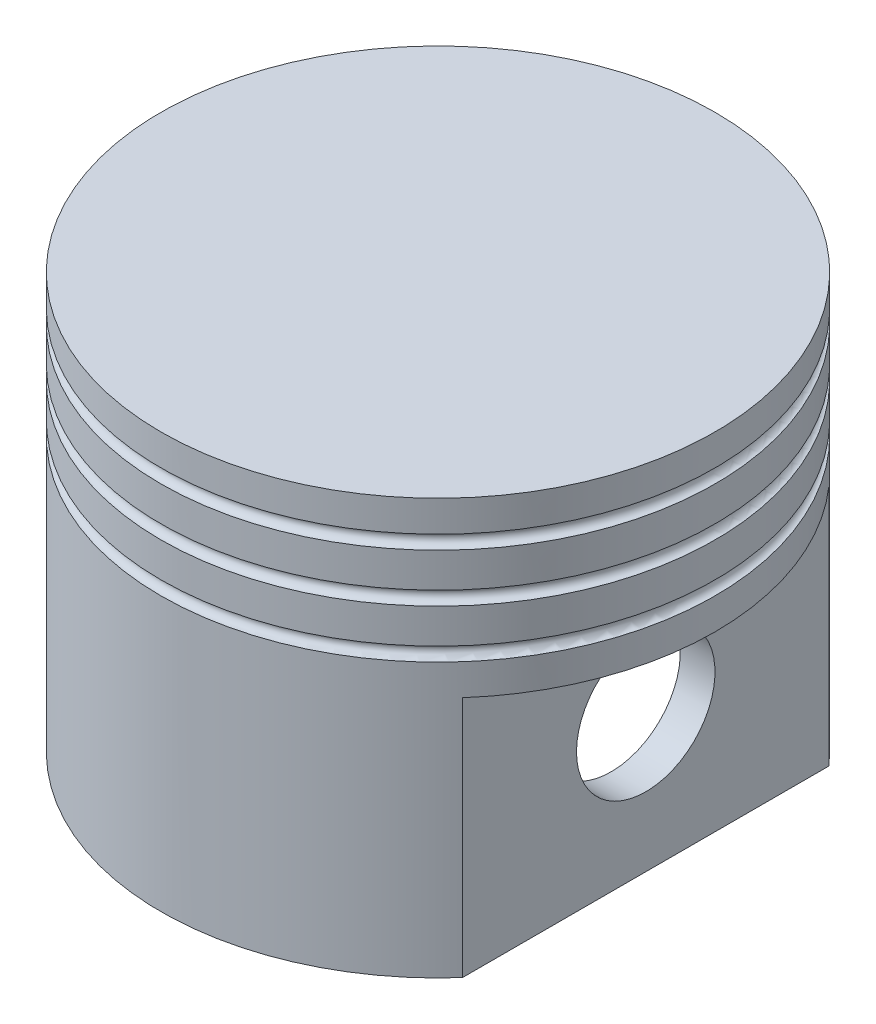
ISO-10303-21;
HEADER;
FILE_DESCRIPTION(('STEP AP214'),'2;1');
FILE_NAME('part.step','',(''),(''),'','','');
FILE_SCHEMA(('AUTOMOTIVE_DESIGN { 1 0 10303 214 1 1 1 1 }'));
ENDSEC;
DATA;
#1=APPLICATION_CONTEXT('core data for automotive mechanical design processes');
#2=APPLICATION_PROTOCOL_DEFINITION('international standard','automotive_design',2000,#1);
#3=PRODUCT_CONTEXT('',#1,'mechanical');
#4=PRODUCT('Part','Part','',(#3));
#5=PRODUCT_RELATED_PRODUCT_CATEGORY('part','',(#4));
#6=PRODUCT_DEFINITION_FORMATION('','',#4);
#7=PRODUCT_DEFINITION_CONTEXT('part definition',#1,'design');
#8=PRODUCT_DEFINITION('design','',#6,#7);
#9=PRODUCT_DEFINITION_SHAPE('','',#8);
#10=(LENGTH_UNIT() NAMED_UNIT(*) SI_UNIT(.MILLI.,.METRE.));
#11=(NAMED_UNIT(*) PLANE_ANGLE_UNIT() SI_UNIT($,.RADIAN.));
#12=(NAMED_UNIT(*) SI_UNIT($,.STERADIAN.) SOLID_ANGLE_UNIT());
#13=UNCERTAINTY_MEASURE_WITH_UNIT(LENGTH_MEASURE(1.E-05),#10,'distance_accuracy_value','');
#14=(GEOMETRIC_REPRESENTATION_CONTEXT(3) GLOBAL_UNCERTAINTY_ASSIGNED_CONTEXT((#13)) GLOBAL_UNIT_ASSIGNED_CONTEXT((#10,
#11,#12)) REPRESENTATION_CONTEXT('',''));
#15=CARTESIAN_POINT('',(0.,0.,0.));
#16=DIRECTION('',(0.,0.,1.));
#17=DIRECTION('',(1.,0.,0.));
#18=AXIS2_PLACEMENT_3D('',#15,#16,#17);
#19=CARTESIAN_POINT('',(0.,60.,0.));
#20=DIRECTION('',(0.,-1.,0.));
#21=DIRECTION('',(0.,0.,-1.));
#22=AXIS2_PLACEMENT_3D('',#19,#20,#21);
#23=CYLINDRICAL_SURFACE('',#22,40.);
#24=CARTESIAN_POINT('',(0.,41.5,0.));
#25=DIRECTION('',(0.,-1.,0.));
#26=DIRECTION('',(0.,0.,-1.));
#27=AXIS2_PLACEMENT_3D('',#24,#25,#26);
#28=CIRCLE('',#27,40.);
#29=CARTESIAN_POINT('',(0.,41.5,-40.));
#30=VERTEX_POINT('',#29);
#31=EDGE_CURVE('E266',#30,#30,#28,.F.);
#32=ORIENTED_EDGE('',*,*,#31,.T.);
#33=EDGE_LOOP('',(#32));
#34=FACE_BOUND('',#33,.T.);
#35=CARTESIAN_POINT('',(0.,46.5,0.));
#36=DIRECTION('',(0.,1.,0.));
#37=DIRECTION('',(0.,0.,1.));
#38=AXIS2_PLACEMENT_3D('',#35,#36,#37);
#39=CIRCLE('',#38,40.);
#40=CARTESIAN_POINT('',(0.,46.5,40.));
#41=VERTEX_POINT('',#40);
#42=EDGE_CURVE('E263',#41,#41,#39,.F.);
#43=ORIENTED_EDGE('',*,*,#42,.T.);
#44=EDGE_LOOP('',(#43));
#45=FACE_BOUND('',#44,.T.);
#46=ADVANCED_FACE('F40',(#34,#45),#23,.T.);
#47=CARTESIAN_POINT('',(0.,48.5,0.));
#48=DIRECTION('',(0.,-1.,0.));
#49=DIRECTION('',(0.,0.,-1.));
#50=AXIS2_PLACEMENT_3D('',#47,#48,#49);
#51=CIRCLE('',#50,40.);
#52=CARTESIAN_POINT('',(0.,48.5,-40.));
#53=VERTEX_POINT('',#52);
#54=EDGE_CURVE('E259',#53,#53,#51,.F.);
#55=ORIENTED_EDGE('',*,*,#54,.T.);
#56=EDGE_LOOP('',(#55));
#57=FACE_BOUND('',#56,.T.);
#58=CARTESIAN_POINT('',(0.,53.5,0.));
#59=DIRECTION('',(0.,1.,0.));
#60=DIRECTION('',(0.,0.,1.));
#61=AXIS2_PLACEMENT_3D('',#58,#59,#60);
#62=CIRCLE('',#61,40.);
#63=CARTESIAN_POINT('',(0.,53.5,40.));
#64=VERTEX_POINT('',#63);
#65=EDGE_CURVE('E254',#64,#64,#62,.F.);
#66=ORIENTED_EDGE('',*,*,#65,.T.);
#67=EDGE_LOOP('',(#66));
#68=FACE_BOUND('',#67,.T.);
#69=ADVANCED_FACE('F215',(#57,#68),#23,.T.);
#70=CARTESIAN_POINT('',(0.,55.5,0.));
#71=DIRECTION('',(0.,-1.,0.));
#72=DIRECTION('',(0.,0.,-1.));
#73=AXIS2_PLACEMENT_3D('',#70,#71,#72);
#74=CIRCLE('',#73,40.);
#75=CARTESIAN_POINT('',(0.,55.5,-40.));
#76=VERTEX_POINT('',#75);
#77=EDGE_CURVE('E250',#76,#76,#74,.F.);
#78=ORIENTED_EDGE('',*,*,#77,.T.);
#79=EDGE_LOOP('',(#78));
#80=FACE_BOUND('',#79,.T.);
#81=CARTESIAN_POINT('',(0.,60.,0.));
#82=DIRECTION('',(0.,1.,0.));
#83=DIRECTION('',(0.,0.,1.));
#84=AXIS2_PLACEMENT_3D('',#81,#82,#83);
#85=CIRCLE('',#84,40.);
#86=CARTESIAN_POINT('',(0.,60.,40.));
#87=VERTEX_POINT('',#86);
#88=EDGE_CURVE('E11',#87,#87,#85,.T.);
#89=ORIENTED_EDGE('',*,*,#88,.F.);
#90=EDGE_LOOP('',(#89));
#91=FACE_BOUND('',#90,.T.);
#92=ADVANCED_FACE('F220',(#80,#91),#23,.T.);
#93=CARTESIAN_POINT('',(0.,60.,0.));
#94=DIRECTION('',(0.,1.,0.));
#95=DIRECTION('',(0.,0.,1.));
#96=AXIS2_PLACEMENT_3D('',#93,#94,#95);
#97=PLANE('',#96);
#98=ORIENTED_EDGE('',*,*,#88,.T.);
#99=EDGE_LOOP('',(#98));
#100=FACE_BOUND('',#99,.T.);
#101=ADVANCED_FACE('F239',(#100),#97,.T.);
#102=CARTESIAN_POINT('',(0.,54.5,0.));
#103=DIRECTION('',(0.,1.,0.));
#104=DIRECTION('',(0.,0.,1.));
#105=AXIS2_PLACEMENT_3D('',#102,#103,#104);
#106=TOROIDAL_SURFACE('',#105,40.,0.999999999999998);
#107=ORIENTED_EDGE('',*,*,#65,.F.);
#108=EDGE_LOOP('',(#107));
#109=FACE_BOUND('',#108,.T.);
#110=ORIENTED_EDGE('',*,*,#77,.F.);
#111=EDGE_LOOP('',(#110));
#112=FACE_BOUND('',#111,.T.);
#113=ADVANCED_FACE('F244',(#109,#112),#106,.F.);
#114=CARTESIAN_POINT('',(0.,47.5,0.));
#115=DIRECTION('',(0.,1.,0.));
#116=DIRECTION('',(0.,0.,1.));
#117=AXIS2_PLACEMENT_3D('',#114,#115,#116);
#118=TOROIDAL_SURFACE('',#117,40.,0.999999999999998);
#119=ORIENTED_EDGE('',*,*,#42,.F.);
#120=EDGE_LOOP('',(#119));
#121=FACE_BOUND('',#120,.T.);
#122=ORIENTED_EDGE('',*,*,#54,.F.);
#123=EDGE_LOOP('',(#122));
#124=FACE_BOUND('',#123,.T.);
#125=ADVANCED_FACE('F276',(#121,#124),#118,.F.);
#126=CARTESIAN_POINT('',(0.,40.5,0.));
#127=DIRECTION('',(0.,1.,0.));
#128=DIRECTION('',(0.,0.,1.));
#129=AXIS2_PLACEMENT_3D('',#126,#127,#128);
#130=TOROIDAL_SURFACE('',#129,40.,0.999999999999998);
#131=CARTESIAN_POINT('',(0.,39.5,0.));
#132=DIRECTION('',(0.,1.,0.));
#133=DIRECTION('',(0.,0.,1.));
#134=AXIS2_PLACEMENT_3D('',#131,#132,#133);
#135=CIRCLE('',#134,40.);
#136=CARTESIAN_POINT('',(0.,39.5,40.));
#137=VERTEX_POINT('',#136);
#138=EDGE_CURVE('E269',#137,#137,#135,.F.);
#139=ORIENTED_EDGE('',*,*,#138,.F.);
#140=EDGE_LOOP('',(#139));
#141=FACE_BOUND('',#140,.T.);
#142=ORIENTED_EDGE('',*,*,#31,.F.);
#143=EDGE_LOOP('',(#142));
#144=FACE_BOUND('',#143,.T.);
#145=ADVANCED_FACE('F273',(#141,#144),#130,.F.);
#146=CARTESIAN_POINT('',(0.,35.,0.));
#147=DIRECTION('',(0.,-1.,0.));
#148=DIRECTION('',(0.,0.,-1.));
#149=AXIS2_PLACEMENT_3D('',#146,#147,#148);
#150=PLANE('',#149);
#151=CARTESIAN_POINT('',(0.,35.,0.));
#152=DIRECTION('',(0.,-1.,0.));
#153=DIRECTION('',(0.,0.,-1.));
#154=AXIS2_PLACEMENT_3D('',#151,#152,#153);
#155=CIRCLE('',#154,40.);
#156=CARTESIAN_POINT('',(-30.,35.,26.4575131106459));
#157=VERTEX_POINT('',#156);
#158=CARTESIAN_POINT('',(-30.,35.,-26.4575131106459));
#159=VERTEX_POINT('',#158);
#160=EDGE_CURVE('E578',#157,#159,#155,.T.);
#161=ORIENTED_EDGE('',*,*,#160,.T.);
#162=DIRECTION('',(0.,0.,1.));
#163=VECTOR('',#162,1.);
#164=CARTESIAN_POINT('',(-30.,35.,26.4575131106459));
#165=LINE('',#164,#163);
#166=EDGE_CURVE('E580',#159,#157,#165,.T.);
#167=ORIENTED_EDGE('',*,*,#166,.T.);
#168=EDGE_LOOP('',(#161,#167));
#169=FACE_BOUND('',#168,.T.);
#170=ADVANCED_FACE('F275',(#169),#150,.T.);
#171=CARTESIAN_POINT('',(-30.,35.,26.4575131106459));
#172=DIRECTION('',(1.,0.,0.));
#173=DIRECTION('',(0.,0.,-1.));
#174=AXIS2_PLACEMENT_3D('',#171,#172,#173);
#175=PLANE('',#174);
#176=CARTESIAN_POINT('',(-30.,20.,0.));
#177=DIRECTION('',(-1.,0.,0.));
#178=DIRECTION('',(0.,0.,1.));
#179=AXIS2_PLACEMENT_3D('',#176,#177,#178);
#180=CIRCLE('',#179,10.);
#181=CARTESIAN_POINT('',(-30.,20.,10.));
#182=VERTEX_POINT('',#181);
#183=EDGE_CURVE('E534',#182,#182,#180,.T.);
#184=ORIENTED_EDGE('',*,*,#183,.F.);
#185=EDGE_LOOP('',(#184));
#186=FACE_BOUND('',#185,.T.);
#187=DIRECTION('',(0.,0.,1.));
#188=VECTOR('',#187,1.);
#189=CARTESIAN_POINT('',(-30.,0.,26.4575131106459));
#190=LINE('',#189,#188);
#191=CARTESIAN_POINT('',(-30.,0.,-26.4575131106459));
#192=VERTEX_POINT('',#191);
#193=CARTESIAN_POINT('',(-30.,0.,26.4575131106459));
#194=VERTEX_POINT('',#193);
#195=EDGE_CURVE('E576',#192,#194,#190,.T.);
#196=ORIENTED_EDGE('',*,*,#195,.T.);
#197=DIRECTION('',(0.,-1.,0.));
#198=VECTOR('',#197,1.);
#199=CARTESIAN_POINT('',(-30.,35.,26.4575131106459));
#200=LINE('',#199,#198);
#201=EDGE_CURVE('E585',#157,#194,#200,.T.);
#202=ORIENTED_EDGE('',*,*,#201,.F.);
#203=ORIENTED_EDGE('',*,*,#166,.F.);
#204=DIRECTION('',(0.,-1.,0.));
#205=VECTOR('',#204,1.);
#206=CARTESIAN_POINT('',(-30.,35.,-26.4575131106459));
#207=LINE('',#206,#205);
#208=EDGE_CURVE('E583',#159,#192,#207,.T.);
#209=ORIENTED_EDGE('',*,*,#208,.T.);
#210=EDGE_LOOP('',(#196,#202,#203,#209));
#211=FACE_BOUND('',#210,.T.);
#212=ADVANCED_FACE('F283',(#186,#211),#175,.F.);
#213=CARTESIAN_POINT('',(0.,0.,0.));
#214=DIRECTION('',(0.,1.,0.));
#215=DIRECTION('',(0.,0.,1.));
#216=AXIS2_PLACEMENT_3D('',#213,#214,#215);
#217=PLANE('',#216);
#218=DIRECTION('',(0.,0.,-1.));
#219=VECTOR('',#218,1.);
#220=CARTESIAN_POINT('',(25.,0.,-26.4575131106459));
#221=LINE('',#220,#219);
#222=CARTESIAN_POINT('',(25.,0.,24.4948974278318));
#223=VERTEX_POINT('',#222);
#224=CARTESIAN_POINT('',(25.,0.,-24.4948974278318));
#225=VERTEX_POINT('',#224);
#226=EDGE_CURVE('E126',#223,#225,#221,.T.);
#227=ORIENTED_EDGE('',*,*,#226,.T.);
#228=CARTESIAN_POINT('',(0.,0.,0.));
#229=DIRECTION('',(0.,1.,0.));
#230=DIRECTION('',(0.,0.,1.));
#231=AXIS2_PLACEMENT_3D('',#228,#229,#230);
#232=CIRCLE('',#231,35.);
#233=CARTESIAN_POINT('',(-25.,0.,-24.4948974278318));
#234=VERTEX_POINT('',#233);
#235=EDGE_CURVE('E137',#225,#234,#232,.T.);
#236=ORIENTED_EDGE('',*,*,#235,.T.);
#237=DIRECTION('',(0.,0.,1.));
#238=VECTOR('',#237,1.);
#239=CARTESIAN_POINT('',(-25.,0.,26.4575131106459));
#240=LINE('',#239,#238);
#241=CARTESIAN_POINT('',(-25.,0.,24.4948974278318));
#242=VERTEX_POINT('',#241);
#243=EDGE_CURVE('E133',#234,#242,#240,.T.);
#244=ORIENTED_EDGE('',*,*,#243,.T.);
#245=CARTESIAN_POINT('',(0.,0.,0.));
#246=DIRECTION('',(0.,1.,0.));
#247=DIRECTION('',(0.,0.,1.));
#248=AXIS2_PLACEMENT_3D('',#245,#246,#247);
#249=CIRCLE('',#248,35.);
#250=EDGE_CURVE('E57',#242,#223,#249,.T.);
#251=ORIENTED_EDGE('',*,*,#250,.T.);
#252=EDGE_LOOP('',(#227,#236,#244,#251));
#253=FACE_BOUND('',#252,.T.);
#254=CARTESIAN_POINT('',(0.,0.,0.));
#255=DIRECTION('',(0.,1.,0.));
#256=DIRECTION('',(0.,0.,1.));
#257=AXIS2_PLACEMENT_3D('',#254,#255,#256);
#258=CIRCLE('',#257,40.);
#259=CARTESIAN_POINT('',(30.,0.,-26.4575131106459));
#260=VERTEX_POINT('',#259);
#261=EDGE_CURVE('E588',#260,#192,#258,.T.);
#262=ORIENTED_EDGE('',*,*,#261,.F.);
#263=DIRECTION('',(0.,0.,-1.));
#264=VECTOR('',#263,1.);
#265=CARTESIAN_POINT('',(30.,0.,-26.4575131106459));
#266=LINE('',#265,#264);
#267=CARTESIAN_POINT('',(30.,0.,26.4575131106459));
#268=VERTEX_POINT('',#267);
#269=EDGE_CURVE('E253',#268,#260,#266,.T.);
#270=ORIENTED_EDGE('',*,*,#269,.F.);
#271=EDGE_CURVE('E49',#194,#268,#258,.T.);
#272=ORIENTED_EDGE('',*,*,#271,.F.);
#273=ORIENTED_EDGE('',*,*,#195,.F.);
#274=EDGE_LOOP('',(#262,#270,#272,#273));
#275=FACE_BOUND('',#274,.T.);
#276=ADVANCED_FACE('F146',(#253,#275),#217,.F.);
#277=CARTESIAN_POINT('',(30.,35.,-26.4575131106459));
#278=DIRECTION('',(-1.,0.,0.));
#279=DIRECTION('',(0.,0.,1.));
#280=AXIS2_PLACEMENT_3D('',#277,#278,#279);
#281=PLANE('',#280);
#282=CARTESIAN_POINT('',(30.,20.,0.));
#283=DIRECTION('',(-1.,0.,0.));
#284=DIRECTION('',(0.,0.,1.));
#285=AXIS2_PLACEMENT_3D('',#282,#283,#284);
#286=CIRCLE('',#285,10.);
#287=CARTESIAN_POINT('',(30.,20.,10.));
#288=VERTEX_POINT('',#287);
#289=EDGE_CURVE('E539',#288,#288,#286,.T.);
#290=ORIENTED_EDGE('',*,*,#289,.T.);
#291=EDGE_LOOP('',(#290));
#292=FACE_BOUND('',#291,.T.);
#293=ORIENTED_EDGE('',*,*,#269,.T.);
#294=DIRECTION('',(0.,-1.,0.));
#295=VECTOR('',#294,1.);
#296=CARTESIAN_POINT('',(30.,35.,-26.4575131106459));
#297=LINE('',#296,#295);
#298=CARTESIAN_POINT('',(30.,35.,-26.4575131106459));
#299=VERTEX_POINT('',#298);
#300=EDGE_CURVE('E573',#299,#260,#297,.T.);
#301=ORIENTED_EDGE('',*,*,#300,.F.);
#302=DIRECTION('',(0.,0.,-1.));
#303=VECTOR('',#302,1.);
#304=CARTESIAN_POINT('',(30.,35.,-26.4575131106459));
#305=LINE('',#304,#303);
#306=CARTESIAN_POINT('',(30.,35.,26.4575131106459));
#307=VERTEX_POINT('',#306);
#308=EDGE_CURVE('E570',#307,#299,#305,.T.);
#309=ORIENTED_EDGE('',*,*,#308,.F.);
#310=DIRECTION('',(0.,-1.,0.));
#311=VECTOR('',#310,1.);
#312=CARTESIAN_POINT('',(30.,35.,26.4575131106459));
#313=LINE('',#312,#311);
#314=EDGE_CURVE('E65',#307,#268,#313,.T.);
#315=ORIENTED_EDGE('',*,*,#314,.T.);
#316=EDGE_LOOP('',(#293,#301,#309,#315));
#317=FACE_BOUND('',#316,.T.);
#318=ADVANCED_FACE('F233',(#292,#317),#281,.F.);
#319=CARTESIAN_POINT('',(0.,35.,0.));
#320=DIRECTION('',(0.,-1.,0.));
#321=DIRECTION('',(0.,0.,-1.));
#322=AXIS2_PLACEMENT_3D('',#319,#320,#321);
#323=PLANE('',#322);
#324=CARTESIAN_POINT('',(0.,35.,0.));
#325=DIRECTION('',(0.,-1.,0.));
#326=DIRECTION('',(0.,0.,-1.));
#327=AXIS2_PLACEMENT_3D('',#324,#325,#326);
#328=CIRCLE('',#327,40.);
#329=EDGE_CURVE('E256',#299,#307,#328,.T.);
#330=ORIENTED_EDGE('',*,*,#329,.T.);
#331=ORIENTED_EDGE('',*,*,#308,.T.);
#332=EDGE_LOOP('',(#330,#331));
#333=FACE_BOUND('',#332,.T.);
#334=ADVANCED_FACE('F225',(#333),#323,.T.);
#335=ORIENTED_EDGE('',*,*,#138,.T.);
#336=EDGE_LOOP('',(#335));
#337=FACE_BOUND('',#336,.T.);
#338=ORIENTED_EDGE('',*,*,#329,.F.);
#339=ORIENTED_EDGE('',*,*,#300,.T.);
#340=ORIENTED_EDGE('',*,*,#261,.T.);
#341=ORIENTED_EDGE('',*,*,#208,.F.);
#342=ORIENTED_EDGE('',*,*,#160,.F.);
#343=ORIENTED_EDGE('',*,*,#201,.T.);
#344=ORIENTED_EDGE('',*,*,#271,.T.);
#345=ORIENTED_EDGE('',*,*,#314,.F.);
#346=EDGE_LOOP('',(#338,#339,#340,#341,#342,#343,#344,#345));
#347=FACE_BOUND('',#346,.T.);
#348=ADVANCED_FACE('F42',(#337,#347),#23,.T.);
#349=CARTESIAN_POINT('',(0.,55.,0.));
#350=DIRECTION('',(0.,1.,0.));
#351=DIRECTION('',(0.,0.,1.));
#352=AXIS2_PLACEMENT_3D('',#349,#350,#351);
#353=PLANE('',#352);
#354=CARTESIAN_POINT('',(0.,55.,0.));
#355=DIRECTION('',(0.,-1.,0.));
#356=DIRECTION('',(0.,0.,-1.));
#357=AXIS2_PLACEMENT_3D('',#354,#355,#356);
#358=CIRCLE('',#357,34.0208696284493);
#359=CARTESIAN_POINT('',(0.,55.,-34.0208696284493));
#360=VERTEX_POINT('',#359);
#361=EDGE_CURVE('E270',#360,#360,#358,.F.);
#362=ORIENTED_EDGE('',*,*,#361,.F.);
#363=EDGE_LOOP('',(#362));
#364=FACE_BOUND('',#363,.T.);
#365=ADVANCED_FACE('F180',(#364),#353,.F.);
#366=CARTESIAN_POINT('',(0.,40.5,0.));
#367=DIRECTION('',(0.,1.,0.));
#368=DIRECTION('',(0.,0.,1.));
#369=AXIS2_PLACEMENT_3D('',#366,#367,#368);
#370=TOROIDAL_SURFACE('',#369,40.,6.);
#371=CARTESIAN_POINT('',(0.,43.8166247903554,0.));
#372=DIRECTION('',(0.,-1.,0.));
#373=DIRECTION('',(0.,0.,-1.));
#374=AXIS2_PLACEMENT_3D('',#371,#372,#373);
#375=CIRCLE('',#374,35.);
#376=CARTESIAN_POINT('',(0.,43.8166247903554,-35.));
#377=VERTEX_POINT('',#376);
#378=EDGE_CURVE('E543',#377,#377,#375,.F.);
#379=ORIENTED_EDGE('',*,*,#378,.T.);
#380=EDGE_LOOP('',(#379));
#381=FACE_BOUND('',#380,.T.);
#382=CARTESIAN_POINT('',(-25.,35.4258700408601,-27.0016331703636));
#383=CARTESIAN_POINT('',(-25.,35.4791467603269,-26.8865885566623));
#384=CARTESIAN_POINT('',(-25.,35.5347074055168,-26.7726145506781));
#385=CARTESIAN_POINT('',(-25.,35.65046502818,-26.5470203084313));
#386=CARTESIAN_POINT('',(-25.,35.7106628644862,-26.4354005130809));
#387=CARTESIAN_POINT('',(-25.,35.8986625425557,-26.103787208857));
#388=CARTESIAN_POINT('',(-25.,36.033548799124,-25.887739156335));
#389=CARTESIAN_POINT('',(-25.,36.3253822110618,-25.4647589088539));
#390=CARTESIAN_POINT('',(-25.,36.4827111040794,-25.2580896015968));
#391=CARTESIAN_POINT('',(-25.,36.8177251781647,-24.8622630523474));
#392=CARTESIAN_POINT('',(-25.,36.9953787298916,-24.6730794067889));
#393=CARTESIAN_POINT('',(-25.,37.2873185831356,-24.3963804980862));
#394=CARTESIAN_POINT('',(-25.,37.3944237805697,-24.3012267680829));
#395=CARTESIAN_POINT('',(-25.,37.6149861346261,-24.1185596089833));
#396=CARTESIAN_POINT('',(-25.,37.7284427333238,-24.0310455105237));
#397=CARTESIAN_POINT('',(-25.,37.9604998692909,-23.8655162023449));
#398=CARTESIAN_POINT('',(-25.,38.0790421230568,-23.7874195378896));
#399=CARTESIAN_POINT('',(-25.,38.3220151870454,-23.640928477262));
#400=CARTESIAN_POINT('',(-25.,38.4464464219595,-23.5725347822581));
#401=CARTESIAN_POINT('',(-25.,38.7015933105647,-23.4462719929425));
#402=CARTESIAN_POINT('',(-25.,38.8323450256104,-23.3884753510941));
#403=CARTESIAN_POINT('',(-25.,39.0986085390805,-23.2852479782219));
#404=CARTESIAN_POINT('',(-25.,39.23411868753,-23.2398130077034));
#405=CARTESIAN_POINT('',(-25.,39.5113795785259,-23.1617687339512));
#406=CARTESIAN_POINT('',(-25.,39.6531977899366,-23.1293955035347));
#407=CARTESIAN_POINT('',(-25.,39.8679393507662,-23.0920241900534));
#408=CARTESIAN_POINT('',(-25.,39.9399241186804,-23.0814271633249));
#409=CARTESIAN_POINT('',(-25.,40.0843629402444,-23.0640523625478));
#410=CARTESIAN_POINT('',(-25.,40.1568170583842,-23.057275125112));
#411=CARTESIAN_POINT('',(-25.,40.2294159135412,-23.0524432037883));
#412=B_SPLINE_CURVE_WITH_KNOTS('',3,(#382,#383,#384,#385,#386,#387,#388,#389,#390,#391,#392,
#393,#394,#395,#396,#397,#398,#399,#400,#401,#402,#403,#404,#405,#406,#407,#408,#409,#410,#411),
.UNSPECIFIED.,.F.,.F.,(4,2,2,2,2,2,2,2,2,2,2,2,2,2,4),(0.,0.380293749023653,0.760658100643536,
1.52368915504133,2.30172850481715,3.07857312600733,3.50809101225367,3.9375712274848,
4.36301990977455,4.78849932073511,5.2167873005052,5.64492821116686,6.08049351806038,
6.2986863085751,6.5169097436799),.UNSPECIFIED.);
#413=CARTESIAN_POINT('',(-25.,37.1833752096446,-24.4948974278318));
#414=VERTEX_POINT('',#413);
#415=CARTESIAN_POINT('',(-25.,39.9999999999995,-23.0742187359821));
#416=VERTEX_POINT('',#415);
#417=EDGE_CURVE('E166',#414,#416,#412,.T.);
#418=ORIENTED_EDGE('',*,*,#417,.F.);
#419=CARTESIAN_POINT('',(0.,37.1833752096446,0.));
#420=DIRECTION('',(0.,1.,0.));
#421=DIRECTION('',(0.,0.,1.));
#422=AXIS2_PLACEMENT_3D('',#419,#420,#421);
#423=CIRCLE('',#422,35.);
#424=CARTESIAN_POINT('',(25.,37.1833752096446,-24.4948974278318));
#425=VERTEX_POINT('',#424);
#426=EDGE_CURVE('E542',#414,#425,#423,.F.);
#427=ORIENTED_EDGE('',*,*,#426,.T.);
#428=CARTESIAN_POINT('',(25.,35.4258700408601,-27.0016331703636));
#429=CARTESIAN_POINT('',(25.,35.4791467603269,-26.8865885566623));
#430=CARTESIAN_POINT('',(25.,35.5347074055168,-26.7726145506781));
#431=CARTESIAN_POINT('',(25.,35.65046502818,-26.5470203084313));
#432=CARTESIAN_POINT('',(25.,35.7106628644862,-26.4354005130809));
#433=CARTESIAN_POINT('',(25.,35.8986625425557,-26.103787208857));
#434=CARTESIAN_POINT('',(25.,36.033548799124,-25.887739156335));
#435=CARTESIAN_POINT('',(25.,36.3253822110618,-25.4647589088539));
#436=CARTESIAN_POINT('',(25.,36.4827111040794,-25.2580896015968));
#437=CARTESIAN_POINT('',(25.,36.8177251781647,-24.8622630523474));
#438=CARTESIAN_POINT('',(25.,36.9953787298916,-24.6730794067889));
#439=CARTESIAN_POINT('',(25.,37.2873185831356,-24.3963804980862));
#440=CARTESIAN_POINT('',(25.,37.3944237805697,-24.3012267680829));
#441=CARTESIAN_POINT('',(25.,37.6149861346261,-24.1185596089833));
#442=CARTESIAN_POINT('',(25.,37.7284427333238,-24.0310455105237));
#443=CARTESIAN_POINT('',(25.,37.9604998692909,-23.8655162023449));
#444=CARTESIAN_POINT('',(25.,38.0790421230568,-23.7874195378896));
#445=CARTESIAN_POINT('',(25.,38.3220151870454,-23.640928477262));
#446=CARTESIAN_POINT('',(25.,38.4464464219595,-23.5725347822581));
#447=CARTESIAN_POINT('',(25.,38.7015933105647,-23.4462719929425));
#448=CARTESIAN_POINT('',(25.,38.8323450256104,-23.3884753510941));
#449=CARTESIAN_POINT('',(25.,39.0986085390805,-23.2852479782219));
#450=CARTESIAN_POINT('',(25.,39.23411868753,-23.2398130077034));
#451=CARTESIAN_POINT('',(25.,39.5113795785259,-23.1617687339512));
#452=CARTESIAN_POINT('',(25.,39.6531977899366,-23.1293955035347));
#453=CARTESIAN_POINT('',(25.,39.8679393507662,-23.0920241900534));
#454=CARTESIAN_POINT('',(25.,39.9399241186804,-23.0814271633249));
#455=CARTESIAN_POINT('',(25.,40.0843629402444,-23.0640523625478));
#456=CARTESIAN_POINT('',(25.,40.1568170583842,-23.057275125112));
#457=CARTESIAN_POINT('',(25.,40.2294159135412,-23.0524432037883));
#458=B_SPLINE_CURVE_WITH_KNOTS('',3,(#428,#429,#430,#431,#432,#433,#434,#435,#436,#437,#438,
#439,#440,#441,#442,#443,#444,#445,#446,#447,#448,#449,#450,#451,#452,#453,#454,#455,#456,#457),
.UNSPECIFIED.,.F.,.F.,(4,2,2,2,2,2,2,2,2,2,2,2,2,2,4),(0.,0.380293749023653,0.760658100643536,
1.52368915504133,2.30172850481715,3.07857312600733,3.50809101225367,3.9375712274848,
4.36301990977455,4.78849932073511,5.2167873005052,5.64492821116686,6.08049351806038,
6.2986863085751,6.5169097436799),.UNSPECIFIED.);
#459=CARTESIAN_POINT('',(25.,40.,-23.0742187359821));
#460=VERTEX_POINT('',#459);
#461=EDGE_CURVE('E129',#425,#460,#458,.T.);
#462=ORIENTED_EDGE('',*,*,#461,.T.);
#463=CARTESIAN_POINT('',(0.,40.,0.));
#464=DIRECTION('',(0.,1.,0.));
#465=DIRECTION('',(0.,0.,1.));
#466=AXIS2_PLACEMENT_3D('',#463,#464,#465);
#467=CIRCLE('',#466,34.0208696284493);
#468=CARTESIAN_POINT('',(25.,39.9999999999995,23.0742187359821));
#469=VERTEX_POINT('',#468);
#470=EDGE_CURVE('E563',#460,#469,#467,.F.);
#471=ORIENTED_EDGE('',*,*,#470,.T.);
#472=CARTESIAN_POINT('',(25.,35.4258700408601,27.0016331703636));
#473=CARTESIAN_POINT('',(25.,35.4791467603269,26.8865885566623));
#474=CARTESIAN_POINT('',(25.,35.5347074055168,26.7726145506781));
#475=CARTESIAN_POINT('',(25.,35.65046502818,26.5470203084313));
#476=CARTESIAN_POINT('',(25.,35.7106628644862,26.4354005130809));
#477=CARTESIAN_POINT('',(25.,35.8986625425557,26.103787208857));
#478=CARTESIAN_POINT('',(25.,36.033548799124,25.887739156335));
#479=CARTESIAN_POINT('',(25.,36.3253822110618,25.4647589088539));
#480=CARTESIAN_POINT('',(25.,36.4827111040794,25.2580896015968));
#481=CARTESIAN_POINT('',(25.,36.8177251781647,24.8622630523474));
#482=CARTESIAN_POINT('',(25.,36.9953787298916,24.6730794067889));
#483=CARTESIAN_POINT('',(25.,37.2873185831356,24.3963804980862));
#484=CARTESIAN_POINT('',(25.,37.3944237805697,24.3012267680829));
#485=CARTESIAN_POINT('',(25.,37.6149861346261,24.1185596089833));
#486=CARTESIAN_POINT('',(25.,37.7284427333238,24.0310455105237));
#487=CARTESIAN_POINT('',(25.,37.9604998692909,23.8655162023449));
#488=CARTESIAN_POINT('',(25.,38.0790421230568,23.7874195378896));
#489=CARTESIAN_POINT('',(25.,38.3220151870454,23.640928477262));
#490=CARTESIAN_POINT('',(25.,38.4464464219595,23.5725347822581));
#491=CARTESIAN_POINT('',(25.,38.7015933105647,23.4462719929425));
#492=CARTESIAN_POINT('',(25.,38.8323450256104,23.3884753510941));
#493=CARTESIAN_POINT('',(25.,39.0986085390805,23.2852479782219));
#494=CARTESIAN_POINT('',(25.,39.23411868753,23.2398130077034));
#495=CARTESIAN_POINT('',(25.,39.5113795785259,23.1617687339512));
#496=CARTESIAN_POINT('',(25.,39.6531977899366,23.1293955035347));
#497=CARTESIAN_POINT('',(25.,39.8679393507662,23.0920241900534));
#498=CARTESIAN_POINT('',(25.,39.9399241186804,23.0814271633249));
#499=CARTESIAN_POINT('',(25.,40.0843629402444,23.0640523625478));
#500=CARTESIAN_POINT('',(25.,40.1568170583842,23.057275125112));
#501=CARTESIAN_POINT('',(25.,40.2294159135412,23.0524432037883));
#502=B_SPLINE_CURVE_WITH_KNOTS('',3,(#472,#473,#474,#475,#476,#477,#478,#479,#480,#481,#482,
#483,#484,#485,#486,#487,#488,#489,#490,#491,#492,#493,#494,#495,#496,#497,#498,#499,#500,#501),
.UNSPECIFIED.,.F.,.F.,(4,2,2,2,2,2,2,2,2,2,2,2,2,2,4),(0.,0.380293749023653,0.760658100643536,
1.52368915504133,2.30172850481715,3.07857312600733,3.50809101225367,3.9375712274848,
4.36301990977455,4.78849932073511,5.2167873005052,5.64492821116686,6.08049351806038,
6.2986863085751,6.5169097436799),.UNSPECIFIED.);
#503=CARTESIAN_POINT('',(25.,37.1833752096446,24.4948974278318));
#504=VERTEX_POINT('',#503);
#505=EDGE_CURVE('E194',#504,#469,#502,.T.);
#506=ORIENTED_EDGE('',*,*,#505,.F.);
#507=CARTESIAN_POINT('',(-25.,37.1833752096446,24.4948974278318));
#508=VERTEX_POINT('',#507);
#509=EDGE_CURVE('E547',#504,#508,#423,.F.);
#510=ORIENTED_EDGE('',*,*,#509,.T.);
#511=CARTESIAN_POINT('',(-25.,35.4258700408601,27.0016331703636));
#512=CARTESIAN_POINT('',(-25.,35.4791467603269,26.8865885566623));
#513=CARTESIAN_POINT('',(-25.,35.5347074055168,26.7726145506781));
#514=CARTESIAN_POINT('',(-25.,35.65046502818,26.5470203084313));
#515=CARTESIAN_POINT('',(-25.,35.7106628644862,26.4354005130809));
#516=CARTESIAN_POINT('',(-25.,35.8986625425557,26.103787208857));
#517=CARTESIAN_POINT('',(-25.,36.033548799124,25.887739156335));
#518=CARTESIAN_POINT('',(-25.,36.3253822110618,25.4647589088539));
#519=CARTESIAN_POINT('',(-25.,36.4827111040794,25.2580896015968));
#520=CARTESIAN_POINT('',(-25.,36.8177251781647,24.8622630523474));
#521=CARTESIAN_POINT('',(-25.,36.9953787298916,24.6730794067889));
#522=CARTESIAN_POINT('',(-25.,37.2873185831356,24.3963804980862));
#523=CARTESIAN_POINT('',(-25.,37.3944237805697,24.3012267680829));
#524=CARTESIAN_POINT('',(-25.,37.6149861346261,24.1185596089833));
#525=CARTESIAN_POINT('',(-25.,37.7284427333238,24.0310455105237));
#526=CARTESIAN_POINT('',(-25.,37.9604998692909,23.8655162023449));
#527=CARTESIAN_POINT('',(-25.,38.0790421230568,23.7874195378896));
#528=CARTESIAN_POINT('',(-25.,38.3220151870454,23.640928477262));
#529=CARTESIAN_POINT('',(-25.,38.4464464219595,23.5725347822581));
#530=CARTESIAN_POINT('',(-25.,38.7015933105647,23.4462719929425));
#531=CARTESIAN_POINT('',(-25.,38.8323450256104,23.3884753510941));
#532=CARTESIAN_POINT('',(-25.,39.0986085390805,23.2852479782219));
#533=CARTESIAN_POINT('',(-25.,39.23411868753,23.2398130077034));
#534=CARTESIAN_POINT('',(-25.,39.5113795785259,23.1617687339512));
#535=CARTESIAN_POINT('',(-25.,39.6531977899366,23.1293955035347));
#536=CARTESIAN_POINT('',(-25.,39.8679393507662,23.0920241900534));
#537=CARTESIAN_POINT('',(-25.,39.9399241186804,23.0814271633249));
#538=CARTESIAN_POINT('',(-25.,40.0843629402444,23.0640523625478));
#539=CARTESIAN_POINT('',(-25.,40.1568170583842,23.057275125112));
#540=CARTESIAN_POINT('',(-25.,40.2294159135412,23.0524432037883));
#541=B_SPLINE_CURVE_WITH_KNOTS('',3,(#511,#512,#513,#514,#515,#516,#517,#518,#519,#520,#521,
#522,#523,#524,#525,#526,#527,#528,#529,#530,#531,#532,#533,#534,#535,#536,#537,#538,#539,#540),
.UNSPECIFIED.,.F.,.F.,(4,2,2,2,2,2,2,2,2,2,2,2,2,2,4),(0.,0.380293749023653,0.760658100643536,
1.52368915504133,2.30172850481715,3.07857312600733,3.50809101225367,3.9375712274848,
4.36301990977455,4.78849932073511,5.2167873005052,5.64492821116686,6.08049351806038,
6.2986863085751,6.5169097436799),.UNSPECIFIED.);
#542=CARTESIAN_POINT('',(-25.,40.,23.0742187359821));
#543=VERTEX_POINT('',#542);
#544=EDGE_CURVE('E189',#508,#543,#541,.T.);
#545=ORIENTED_EDGE('',*,*,#544,.T.);
#546=CARTESIAN_POINT('',(0.,40.,0.));
#547=DIRECTION('',(0.,1.,0.));
#548=DIRECTION('',(0.,0.,1.));
#549=AXIS2_PLACEMENT_3D('',#546,#547,#548);
#550=CIRCLE('',#549,34.0208696284493);
#551=EDGE_CURVE('E561',#416,#543,#550,.T.);
#552=ORIENTED_EDGE('',*,*,#551,.F.);
#553=EDGE_LOOP('',(#418,#427,#462,#471,#506,#510,#545,#552));
#554=FACE_BOUND('',#553,.T.);
#555=ADVANCED_FACE('F175',(#381,#554),#370,.T.);
#556=CARTESIAN_POINT('',(0.,60.,0.));
#557=DIRECTION('',(0.,-1.,0.));
#558=DIRECTION('',(0.,0.,-1.));
#559=AXIS2_PLACEMENT_3D('',#556,#557,#558);
#560=CYLINDRICAL_SURFACE('',#559,35.);
#561=DIRECTION('',(0.,-1.,0.));
#562=VECTOR('',#561,1.);
#563=CARTESIAN_POINT('',(-25.,40.,-24.4948974278318));
#564=LINE('',#563,#562);
#565=EDGE_CURVE('E140',#414,#234,#564,.T.);
#566=ORIENTED_EDGE('',*,*,#565,.T.);
#567=ORIENTED_EDGE('',*,*,#235,.F.);
#568=DIRECTION('',(0.,-1.,0.));
#569=VECTOR('',#568,1.);
#570=CARTESIAN_POINT('',(25.,40.,-24.4948974278318));
#571=LINE('',#570,#569);
#572=EDGE_CURVE('E121',#425,#225,#571,.T.);
#573=ORIENTED_EDGE('',*,*,#572,.F.);
#574=ORIENTED_EDGE('',*,*,#426,.F.);
#575=EDGE_LOOP('',(#566,#567,#573,#574));
#576=FACE_BOUND('',#575,.T.);
#577=ADVANCED_FACE('F138',(#576),#560,.F.);
#578=ORIENTED_EDGE('',*,*,#378,.F.);
#579=EDGE_LOOP('',(#578));
#580=FACE_BOUND('',#579,.T.);
#581=CARTESIAN_POINT('',(0.,44.1833752096446,0.));
#582=DIRECTION('',(0.,1.,0.));
#583=DIRECTION('',(0.,0.,1.));
#584=AXIS2_PLACEMENT_3D('',#581,#582,#583);
#585=CIRCLE('',#584,35.);
#586=CARTESIAN_POINT('',(0.,44.1833752096446,35.));
#587=VERTEX_POINT('',#586);
#588=EDGE_CURVE('E546',#587,#587,#585,.F.);
#589=ORIENTED_EDGE('',*,*,#588,.F.);
#590=EDGE_LOOP('',(#589));
#591=FACE_BOUND('',#590,.T.);
#592=ADVANCED_FACE('F339',(#580,#591),#560,.F.);
#593=CARTESIAN_POINT('',(0.,50.8166247903554,0.));
#594=DIRECTION('',(0.,-1.,0.));
#595=DIRECTION('',(0.,0.,-1.));
#596=AXIS2_PLACEMENT_3D('',#593,#594,#595);
#597=CIRCLE('',#596,35.);
#598=CARTESIAN_POINT('',(0.,50.8166247903554,-35.));
#599=VERTEX_POINT('',#598);
#600=EDGE_CURVE('E153',#599,#599,#597,.F.);
#601=ORIENTED_EDGE('',*,*,#600,.F.);
#602=EDGE_LOOP('',(#601));
#603=FACE_BOUND('',#602,.T.);
#604=CARTESIAN_POINT('',(0.,51.1833752096446,0.));
#605=DIRECTION('',(0.,1.,0.));
#606=DIRECTION('',(0.,0.,1.));
#607=AXIS2_PLACEMENT_3D('',#604,#605,#606);
#608=CIRCLE('',#607,35.);
#609=CARTESIAN_POINT('',(0.,51.1833752096446,35.));
#610=VERTEX_POINT('',#609);
#611=EDGE_CURVE('E149',#610,#610,#608,.F.);
#612=ORIENTED_EDGE('',*,*,#611,.F.);
#613=EDGE_LOOP('',(#612));
#614=FACE_BOUND('',#613,.T.);
#615=ADVANCED_FACE('F349',(#603,#614),#560,.F.);
#616=CARTESIAN_POINT('',(0.,54.5,0.));
#617=DIRECTION('',(0.,1.,0.));
#618=DIRECTION('',(0.,0.,1.));
#619=AXIS2_PLACEMENT_3D('',#616,#617,#618);
#620=TOROIDAL_SURFACE('',#619,40.,6.);
#621=ORIENTED_EDGE('',*,*,#361,.T.);
#622=EDGE_LOOP('',(#621));
#623=FACE_BOUND('',#622,.T.);
#624=ORIENTED_EDGE('',*,*,#611,.T.);
#625=EDGE_LOOP('',(#624));
#626=FACE_BOUND('',#625,.T.);
#627=ADVANCED_FACE('F358',(#623,#626),#620,.T.);
#628=CARTESIAN_POINT('',(0.,47.5,0.));
#629=DIRECTION('',(0.,1.,0.));
#630=DIRECTION('',(0.,0.,1.));
#631=AXIS2_PLACEMENT_3D('',#628,#629,#630);
#632=TOROIDAL_SURFACE('',#631,40.,6.);
#633=ORIENTED_EDGE('',*,*,#588,.T.);
#634=EDGE_LOOP('',(#633));
#635=FACE_BOUND('',#634,.T.);
#636=ORIENTED_EDGE('',*,*,#600,.T.);
#637=EDGE_LOOP('',(#636));
#638=FACE_BOUND('',#637,.T.);
#639=ADVANCED_FACE('F182',(#635,#638),#632,.T.);
#640=CARTESIAN_POINT('',(0.,40.,0.));
#641=DIRECTION('',(0.,-1.,0.));
#642=DIRECTION('',(0.,0.,-1.));
#643=AXIS2_PLACEMENT_3D('',#640,#641,#642);
#644=PLANE('',#643);
#645=ORIENTED_EDGE('',*,*,#551,.T.);
#646=DIRECTION('',(0.,0.,1.));
#647=VECTOR('',#646,1.);
#648=CARTESIAN_POINT('',(-25.,40.,0.));
#649=LINE('',#648,#647);
#650=EDGE_CURVE('E158',#416,#543,#649,.T.);
#651=ORIENTED_EDGE('',*,*,#650,.F.);
#652=EDGE_LOOP('',(#645,#651));
#653=FACE_BOUND('',#652,.T.);
#654=ADVANCED_FACE('F184',(#653),#644,.F.);
#655=CARTESIAN_POINT('',(-25.,35.,26.4575131106459));
#656=DIRECTION('',(1.,0.,0.));
#657=DIRECTION('',(0.,0.,-1.));
#658=AXIS2_PLACEMENT_3D('',#655,#656,#657);
#659=PLANE('',#658);
#660=CARTESIAN_POINT('',(-25.,20.,0.));
#661=DIRECTION('',(1.,0.,0.));
#662=DIRECTION('',(0.,0.,-1.));
#663=AXIS2_PLACEMENT_3D('',#660,#661,#662);
#664=CIRCLE('',#663,10.);
#665=CARTESIAN_POINT('',(-25.,20.,-10.));
#666=VERTEX_POINT('',#665);
#667=EDGE_CURVE('E531',#666,#666,#664,.T.);
#668=ORIENTED_EDGE('',*,*,#667,.F.);
#669=EDGE_LOOP('',(#668));
#670=FACE_BOUND('',#669,.T.);
#671=DIRECTION('',(0.,-1.,0.));
#672=VECTOR('',#671,1.);
#673=CARTESIAN_POINT('',(-25.,40.,24.4948974278318));
#674=LINE('',#673,#672);
#675=EDGE_CURVE('E144',#508,#242,#674,.T.);
#676=ORIENTED_EDGE('',*,*,#675,.T.);
#677=ORIENTED_EDGE('',*,*,#243,.F.);
#678=ORIENTED_EDGE('',*,*,#565,.F.);
#679=ORIENTED_EDGE('',*,*,#417,.T.);
#680=ORIENTED_EDGE('',*,*,#650,.T.);
#681=ORIENTED_EDGE('',*,*,#544,.F.);
#682=EDGE_LOOP('',(#676,#677,#678,#679,#680,#681));
#683=FACE_BOUND('',#682,.T.);
#684=ADVANCED_FACE('F200',(#670,#683),#659,.T.);
#685=CARTESIAN_POINT('',(25.,35.,-26.4575131106459));
#686=DIRECTION('',(-1.,0.,0.));
#687=DIRECTION('',(0.,0.,1.));
#688=AXIS2_PLACEMENT_3D('',#685,#686,#687);
#689=PLANE('',#688);
#690=CARTESIAN_POINT('',(25.,20.,0.));
#691=DIRECTION('',(-1.,0.,0.));
#692=DIRECTION('',(0.,0.,1.));
#693=AXIS2_PLACEMENT_3D('',#690,#691,#692);
#694=CIRCLE('',#693,10.);
#695=CARTESIAN_POINT('',(25.,20.,10.));
#696=VERTEX_POINT('',#695);
#697=EDGE_CURVE('E44',#696,#696,#694,.T.);
#698=ORIENTED_EDGE('',*,*,#697,.F.);
#699=EDGE_LOOP('',(#698));
#700=FACE_BOUND('',#699,.T.);
#701=ORIENTED_EDGE('',*,*,#505,.T.);
#702=DIRECTION('',(0.,0.,-1.));
#703=VECTOR('',#702,1.);
#704=CARTESIAN_POINT('',(25.,40.,0.));
#705=LINE('',#704,#703);
#706=EDGE_CURVE('E148',#469,#460,#705,.T.);
#707=ORIENTED_EDGE('',*,*,#706,.T.);
#708=ORIENTED_EDGE('',*,*,#461,.F.);
#709=ORIENTED_EDGE('',*,*,#572,.T.);
#710=ORIENTED_EDGE('',*,*,#226,.F.);
#711=DIRECTION('',(0.,-1.,0.));
#712=VECTOR('',#711,1.);
#713=CARTESIAN_POINT('',(25.,40.,24.4948974278318));
#714=LINE('',#713,#712);
#715=EDGE_CURVE('E134',#504,#223,#714,.T.);
#716=ORIENTED_EDGE('',*,*,#715,.F.);
#717=EDGE_LOOP('',(#701,#707,#708,#709,#710,#716));
#718=FACE_BOUND('',#717,.T.);
#719=ADVANCED_FACE('F123',(#700,#718),#689,.T.);
#720=CARTESIAN_POINT('',(0.,40.,0.));
#721=DIRECTION('',(0.,-1.,0.));
#722=DIRECTION('',(0.,0.,-1.));
#723=AXIS2_PLACEMENT_3D('',#720,#721,#722);
#724=PLANE('',#723);
#725=ORIENTED_EDGE('',*,*,#706,.F.);
#726=ORIENTED_EDGE('',*,*,#470,.F.);
#727=EDGE_LOOP('',(#725,#726));
#728=FACE_BOUND('',#727,.T.);
#729=ADVANCED_FACE('F209',(#728),#724,.F.);
#730=ORIENTED_EDGE('',*,*,#509,.F.);
#731=ORIENTED_EDGE('',*,*,#715,.T.);
#732=ORIENTED_EDGE('',*,*,#250,.F.);
#733=ORIENTED_EDGE('',*,*,#675,.F.);
#734=EDGE_LOOP('',(#730,#731,#732,#733));
#735=FACE_BOUND('',#734,.T.);
#736=ADVANCED_FACE('F341',(#735),#560,.F.);
#737=CARTESIAN_POINT('',(40.,20.,0.));
#738=DIRECTION('',(-1.,0.,0.));
#739=DIRECTION('',(0.,0.,1.));
#740=AXIS2_PLACEMENT_3D('',#737,#738,#739);
#741=CYLINDRICAL_SURFACE('',#740,10.);
#742=ORIENTED_EDGE('',*,*,#697,.T.);
#743=EDGE_LOOP('',(#742));
#744=FACE_BOUND('',#743,.T.);
#745=ORIENTED_EDGE('',*,*,#289,.F.);
#746=EDGE_LOOP('',(#745));
#747=FACE_BOUND('',#746,.T.);
#748=ADVANCED_FACE('F408',(#744,#747),#741,.F.);
#749=ORIENTED_EDGE('',*,*,#667,.T.);
#750=EDGE_LOOP('',(#749));
#751=FACE_BOUND('',#750,.T.);
#752=ORIENTED_EDGE('',*,*,#183,.T.);
#753=EDGE_LOOP('',(#752));
#754=FACE_BOUND('',#753,.T.);
#755=ADVANCED_FACE('F416',(#751,#754),#741,.F.);
#756=CLOSED_SHELL('',(#46,#69,#92,#101,#113,#125,#145,#170,#212,#276,#318,#334,#348,#365,#555,
#577,#592,#615,#627,#639,#654,#684,#719,#729,#736,#748,#755));
#757=MANIFOLD_SOLID_BREP('B2',#756);
#758=ADVANCED_BREP_SHAPE_REPRESENTATION('',(#18,#757),#14);
#759=SHAPE_DEFINITION_REPRESENTATION(#9,#758);
ENDSEC;
END-ISO-10303-21;
